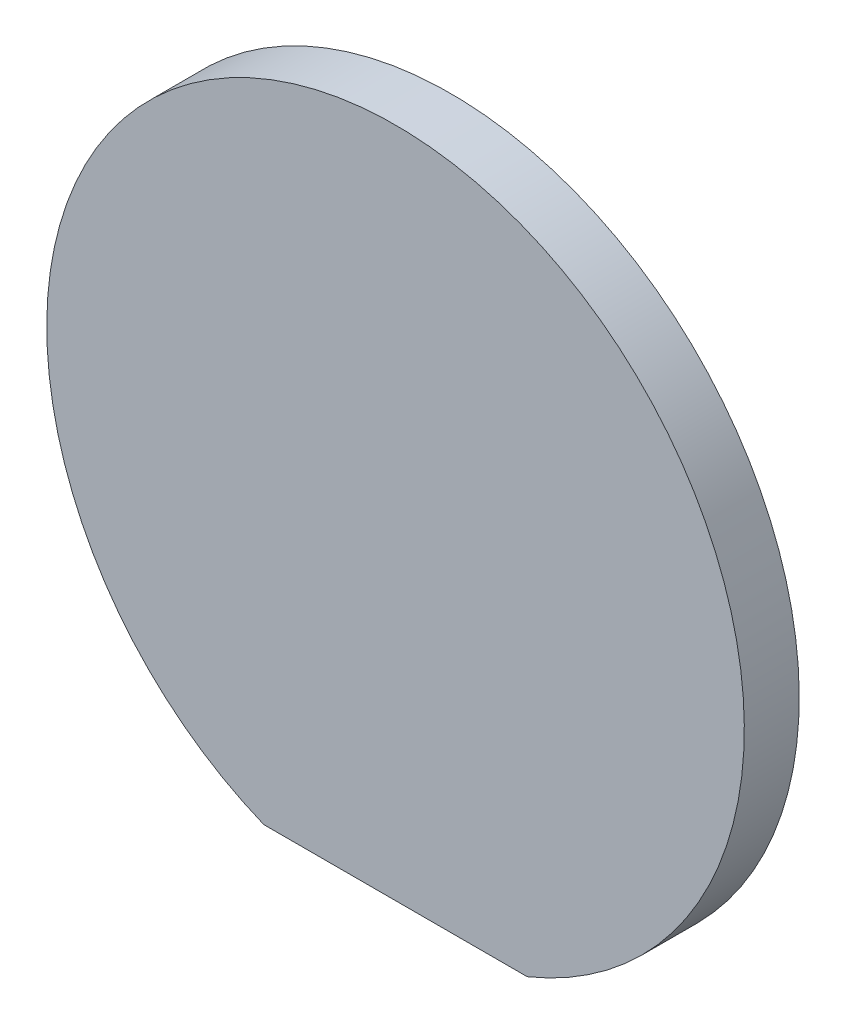
ISO-10303-21;
HEADER;
FILE_DESCRIPTION(('STEP AP214'),'2;1');
FILE_NAME('part.step','',(''),(''),'','','');
FILE_SCHEMA(('AUTOMOTIVE_DESIGN { 1 0 10303 214 1 1 1 1 }'));
ENDSEC;
DATA;
#1=APPLICATION_CONTEXT('core data for automotive mechanical design processes');
#2=APPLICATION_PROTOCOL_DEFINITION('international standard','automotive_design',2000,#1);
#3=PRODUCT_CONTEXT('',#1,'mechanical');
#4=PRODUCT('Part','Part','',(#3));
#5=PRODUCT_RELATED_PRODUCT_CATEGORY('part','',(#4));
#6=PRODUCT_DEFINITION_FORMATION('','',#4);
#7=PRODUCT_DEFINITION_CONTEXT('part definition',#1,'design');
#8=PRODUCT_DEFINITION('design','',#6,#7);
#9=PRODUCT_DEFINITION_SHAPE('','',#8);
#10=(LENGTH_UNIT() NAMED_UNIT(*) SI_UNIT(.MILLI.,.METRE.));
#11=(NAMED_UNIT(*) PLANE_ANGLE_UNIT() SI_UNIT($,.RADIAN.));
#12=(NAMED_UNIT(*) SI_UNIT($,.STERADIAN.) SOLID_ANGLE_UNIT());
#13=UNCERTAINTY_MEASURE_WITH_UNIT(LENGTH_MEASURE(1.E-05),#10,'distance_accuracy_value','');
#14=(GEOMETRIC_REPRESENTATION_CONTEXT(3) GLOBAL_UNCERTAINTY_ASSIGNED_CONTEXT((#13)) GLOBAL_UNIT_ASSIGNED_CONTEXT((#10,
#11,#12)) REPRESENTATION_CONTEXT('',''));
#15=CARTESIAN_POINT('',(0.,0.,0.));
#16=DIRECTION('',(0.,0.,1.));
#17=DIRECTION('',(1.,0.,0.));
#18=AXIS2_PLACEMENT_3D('',#15,#16,#17);
#19=CARTESIAN_POINT('',(0.,0.,1.));
#20=DIRECTION('',(0.,0.,-1.));
#21=DIRECTION('',(-1.,0.,0.));
#22=AXIS2_PLACEMENT_3D('',#19,#20,#21);
#23=CYLINDRICAL_SURFACE('',#22,6.35);
#24=CARTESIAN_POINT('',(0.,0.,1.));
#25=DIRECTION('',(0.,0.,1.));
#26=DIRECTION('',(1.,0.,0.));
#27=AXIS2_PLACEMENT_3D('',#24,#25,#26);
#28=CIRCLE('',#27,6.35);
#29=CARTESIAN_POINT('',(2.39751955153655,-5.88,1.));
#30=VERTEX_POINT('',#29);
#31=CARTESIAN_POINT('',(-2.39751955153655,-5.88,1.));
#32=VERTEX_POINT('',#31);
#33=EDGE_CURVE('E47',#30,#32,#28,.T.);
#34=ORIENTED_EDGE('',*,*,#33,.F.);
#35=DIRECTION('',(0.,0.,-1.));
#36=VECTOR('',#35,1.);
#37=CARTESIAN_POINT('',(2.39751955153655,-5.88,1.));
#38=LINE('',#37,#36);
#39=CARTESIAN_POINT('',(2.39751955153655,-5.88,0.));
#40=VERTEX_POINT('',#39);
#41=EDGE_CURVE('E61',#30,#40,#38,.T.);
#42=ORIENTED_EDGE('',*,*,#41,.T.);
#43=CARTESIAN_POINT('',(0.,0.,0.));
#44=DIRECTION('',(0.,0.,1.));
#45=DIRECTION('',(1.,0.,0.));
#46=AXIS2_PLACEMENT_3D('',#43,#44,#45);
#47=CIRCLE('',#46,6.35);
#48=CARTESIAN_POINT('',(-2.39751955153655,-5.88,0.));
#49=VERTEX_POINT('',#48);
#50=EDGE_CURVE('E70',#40,#49,#47,.T.);
#51=ORIENTED_EDGE('',*,*,#50,.T.);
#52=DIRECTION('',(0.,0.,-1.));
#53=VECTOR('',#52,1.);
#54=CARTESIAN_POINT('',(-2.39751955153655,-5.88,1.));
#55=LINE('',#54,#53);
#56=EDGE_CURVE('E54',#49,#32,#55,.F.);
#57=ORIENTED_EDGE('',*,*,#56,.T.);
#58=EDGE_LOOP('',(#34,#42,#51,#57));
#59=FACE_BOUND('',#58,.T.);
#60=ADVANCED_FACE('F39',(#59),#23,.T.);
#61=CARTESIAN_POINT('',(0.,0.,1.));
#62=DIRECTION('',(0.,0.,1.));
#63=DIRECTION('',(1.,0.,0.));
#64=AXIS2_PLACEMENT_3D('',#61,#62,#63);
#65=PLANE('',#64);
#66=DIRECTION('',(-1.,0.,0.));
#67=VECTOR('',#66,1.);
#68=CARTESIAN_POINT('',(-5.88733807369101,-5.88,1.));
#69=LINE('',#68,#67);
#70=EDGE_CURVE('E64',#30,#32,#69,.T.);
#71=ORIENTED_EDGE('',*,*,#70,.F.);
#72=ORIENTED_EDGE('',*,*,#33,.T.);
#73=EDGE_LOOP('',(#71,#72));
#74=FACE_BOUND('',#73,.T.);
#75=ADVANCED_FACE('F74',(#74),#65,.T.);
#76=CARTESIAN_POINT('',(0.,0.,0.));
#77=DIRECTION('',(0.,0.,1.));
#78=DIRECTION('',(1.,0.,0.));
#79=AXIS2_PLACEMENT_3D('',#76,#77,#78);
#80=PLANE('',#79);
#81=ORIENTED_EDGE('',*,*,#50,.F.);
#82=DIRECTION('',(-1.,0.,0.));
#83=VECTOR('',#82,1.);
#84=CARTESIAN_POINT('',(0.,-5.88,0.));
#85=LINE('',#84,#83);
#86=EDGE_CURVE('E11',#40,#49,#85,.T.);
#87=ORIENTED_EDGE('',*,*,#86,.T.);
#88=EDGE_LOOP('',(#81,#87));
#89=FACE_BOUND('',#88,.T.);
#90=ADVANCED_FACE('F83',(#89),#80,.F.);
#91=CARTESIAN_POINT('',(-5.88733807369101,-5.88,0.));
#92=DIRECTION('',(0.,1.,0.));
#93=DIRECTION('',(0.,0.,1.));
#94=AXIS2_PLACEMENT_3D('',#91,#92,#93);
#95=PLANE('',#94);
#96=ORIENTED_EDGE('',*,*,#70,.T.);
#97=ORIENTED_EDGE('',*,*,#56,.F.);
#98=ORIENTED_EDGE('',*,*,#86,.F.);
#99=ORIENTED_EDGE('',*,*,#41,.F.);
#100=EDGE_LOOP('',(#96,#97,#98,#99));
#101=FACE_BOUND('',#100,.T.);
#102=ADVANCED_FACE('F63',(#101),#95,.F.);
#103=CLOSED_SHELL('',(#60,#75,#90,#102));
#104=MANIFOLD_SOLID_BREP('B2',#103);
#105=ADVANCED_BREP_SHAPE_REPRESENTATION('',(#18,#104),#14);
#106=SHAPE_DEFINITION_REPRESENTATION(#9,#105);
ENDSEC;
END-ISO-10303-21;
